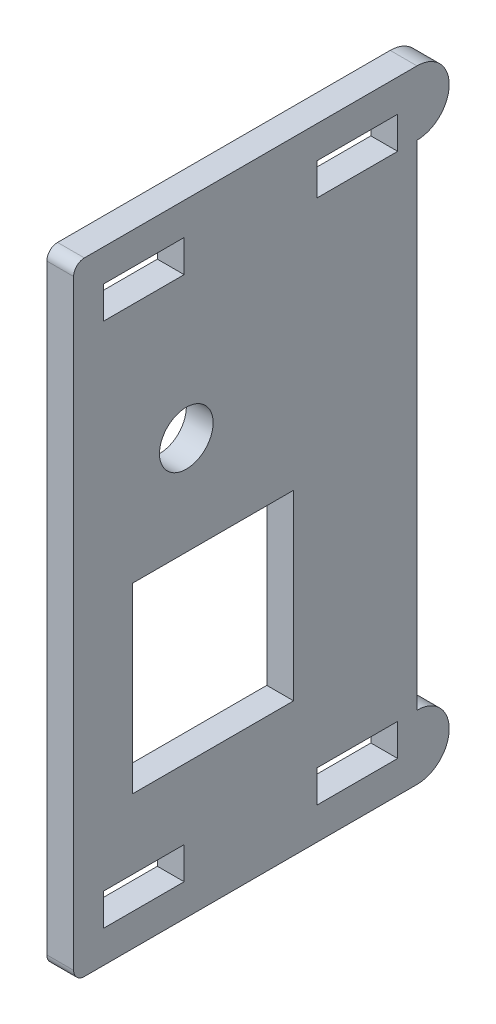
ISO-10303-21;
HEADER;
FILE_DESCRIPTION(('STEP AP214'),'2;1');
FILE_NAME('part.step','',(''),(''),'','','');
FILE_SCHEMA(('AUTOMOTIVE_DESIGN { 1 0 10303 214 1 1 1 1 }'));
ENDSEC;
DATA;
#1=APPLICATION_CONTEXT('core data for automotive mechanical design processes');
#2=APPLICATION_PROTOCOL_DEFINITION('international standard','automotive_design',2000,#1);
#3=PRODUCT_CONTEXT('',#1,'mechanical');
#4=PRODUCT('Part','Part','',(#3));
#5=PRODUCT_RELATED_PRODUCT_CATEGORY('part','',(#4));
#6=PRODUCT_DEFINITION_FORMATION('','',#4);
#7=PRODUCT_DEFINITION_CONTEXT('part definition',#1,'design');
#8=PRODUCT_DEFINITION('design','',#6,#7);
#9=PRODUCT_DEFINITION_SHAPE('','',#8);
#10=(LENGTH_UNIT() NAMED_UNIT(*) SI_UNIT(.MILLI.,.METRE.));
#11=(NAMED_UNIT(*) PLANE_ANGLE_UNIT() SI_UNIT($,.RADIAN.));
#12=(NAMED_UNIT(*) SI_UNIT($,.STERADIAN.) SOLID_ANGLE_UNIT());
#13=UNCERTAINTY_MEASURE_WITH_UNIT(LENGTH_MEASURE(1.E-05),#10,'distance_accuracy_value','');
#14=(GEOMETRIC_REPRESENTATION_CONTEXT(3) GLOBAL_UNCERTAINTY_ASSIGNED_CONTEXT((#13)) GLOBAL_UNIT_ASSIGNED_CONTEXT((#10,
#11,#12)) REPRESENTATION_CONTEXT('',''));
#15=CARTESIAN_POINT('',(0.,0.,0.));
#16=DIRECTION('',(0.,0.,1.));
#17=DIRECTION('',(1.,0.,0.));
#18=AXIS2_PLACEMENT_3D('',#15,#16,#17);
#19=CARTESIAN_POINT('',(2.5,0.,0.));
#20=DIRECTION('',(1.,0.,0.));
#21=DIRECTION('',(0.,0.,-1.));
#22=AXIS2_PLACEMENT_3D('',#19,#20,#21);
#23=PLANE('',#22);
#24=CARTESIAN_POINT('',(2.5,9.7,6.99999999999998));
#25=DIRECTION('',(-1.,0.,0.));
#26=DIRECTION('',(0.,0.,1.));
#27=AXIS2_PLACEMENT_3D('',#24,#25,#26);
#28=CIRCLE('',#27,2.5);
#29=CARTESIAN_POINT('',(2.5,9.7,9.49999999999998));
#30=VERTEX_POINT('',#29);
#31=EDGE_CURVE('E278',#30,#30,#28,.T.);
#32=ORIENTED_EDGE('',*,*,#31,.T.);
#33=EDGE_LOOP('',(#32));
#34=FACE_BOUND('',#33,.T.);
#35=DIRECTION('',(0.,-1.,0.));
#36=VECTOR('',#35,1.);
#37=CARTESIAN_POINT('',(2.5,0.500000000000006,-3.00000000000002));
#38=LINE('',#37,#36);
#39=CARTESIAN_POINT('',(2.5,0.500000000000006,-3.00000000000002));
#40=VERTEX_POINT('',#39);
#41=CARTESIAN_POINT('',(2.5,-16.5,-3.00000000000002));
#42=VERTEX_POINT('',#41);
#43=EDGE_CURVE('E245',#40,#42,#38,.T.);
#44=ORIENTED_EDGE('',*,*,#43,.T.);
#45=DIRECTION('',(0.,0.,1.));
#46=VECTOR('',#45,1.);
#47=CARTESIAN_POINT('',(2.5,-16.5,-3.00000000000002));
#48=LINE('',#47,#46);
#49=CARTESIAN_POINT('',(2.5,-16.5,12.));
#50=VERTEX_POINT('',#49);
#51=EDGE_CURVE('E257',#42,#50,#48,.T.);
#52=ORIENTED_EDGE('',*,*,#51,.T.);
#53=DIRECTION('',(0.,1.,0.));
#54=VECTOR('',#53,1.);
#55=CARTESIAN_POINT('',(2.5,0.500000000000006,12.));
#56=LINE('',#55,#54);
#57=CARTESIAN_POINT('',(2.5,0.500000000000006,12.));
#58=VERTEX_POINT('',#57);
#59=EDGE_CURVE('E261',#50,#58,#56,.T.);
#60=ORIENTED_EDGE('',*,*,#59,.T.);
#61=DIRECTION('',(0.,0.,-1.));
#62=VECTOR('',#61,1.);
#63=CARTESIAN_POINT('',(2.5,0.500000000000006,-3.00000000000002));
#64=LINE('',#63,#62);
#65=EDGE_CURVE('E253',#58,#40,#64,.T.);
#66=ORIENTED_EDGE('',*,*,#65,.T.);
#67=EDGE_LOOP('',(#44,#52,#60,#66));
#68=FACE_BOUND('',#67,.T.);
#69=DIRECTION('',(0.,0.,-1.));
#70=VECTOR('',#69,1.);
#71=CARTESIAN_POINT('',(2.5,-23.,14.7));
#72=LINE('',#71,#70);
#73=CARTESIAN_POINT('',(2.5,-23.,14.7));
#74=VERTEX_POINT('',#73);
#75=CARTESIAN_POINT('',(2.5,-23.,7.20000000000001));
#76=VERTEX_POINT('',#75);
#77=EDGE_CURVE('E315',#74,#76,#72,.T.);
#78=ORIENTED_EDGE('',*,*,#77,.T.);
#79=DIRECTION('',(0.,-1.,0.));
#80=VECTOR('',#79,1.);
#81=CARTESIAN_POINT('',(2.5,-23.,7.20000000000001));
#82=LINE('',#81,#80);
#83=CARTESIAN_POINT('',(2.5,-26.,7.20000000000001));
#84=VERTEX_POINT('',#83);
#85=EDGE_CURVE('E318',#76,#84,#82,.T.);
#86=ORIENTED_EDGE('',*,*,#85,.T.);
#87=DIRECTION('',(0.,0.,1.));
#88=VECTOR('',#87,1.);
#89=CARTESIAN_POINT('',(2.5,-26.,7.20000000000001));
#90=LINE('',#89,#88);
#91=CARTESIAN_POINT('',(2.5,-26.,14.7));
#92=VERTEX_POINT('',#91);
#93=EDGE_CURVE('E322',#84,#92,#90,.T.);
#94=ORIENTED_EDGE('',*,*,#93,.T.);
#95=DIRECTION('',(0.,1.,0.));
#96=VECTOR('',#95,1.);
#97=CARTESIAN_POINT('',(2.5,-26.,14.7));
#98=LINE('',#97,#96);
#99=EDGE_CURVE('E325',#92,#74,#98,.T.);
#100=ORIENTED_EDGE('',*,*,#99,.T.);
#101=EDGE_LOOP('',(#78,#86,#94,#100));
#102=FACE_BOUND('',#101,.T.);
#103=DIRECTION('',(0.,0.,-1.));
#104=VECTOR('',#103,1.);
#105=CARTESIAN_POINT('',(2.5,-23.,-5.2));
#106=LINE('',#105,#104);
#107=CARTESIAN_POINT('',(2.5,-23.,-5.2));
#108=VERTEX_POINT('',#107);
#109=CARTESIAN_POINT('',(2.5,-23.,-12.7));
#110=VERTEX_POINT('',#109);
#111=EDGE_CURVE('E347',#108,#110,#106,.T.);
#112=ORIENTED_EDGE('',*,*,#111,.T.);
#113=DIRECTION('',(0.,-1.,0.));
#114=VECTOR('',#113,1.);
#115=CARTESIAN_POINT('',(2.5,-23.,-12.7));
#116=LINE('',#115,#114);
#117=CARTESIAN_POINT('',(2.5,-26.,-12.7));
#118=VERTEX_POINT('',#117);
#119=EDGE_CURVE('E350',#110,#118,#116,.T.);
#120=ORIENTED_EDGE('',*,*,#119,.T.);
#121=DIRECTION('',(0.,0.,1.));
#122=VECTOR('',#121,1.);
#123=CARTESIAN_POINT('',(2.5,-26.,-12.7));
#124=LINE('',#123,#122);
#125=CARTESIAN_POINT('',(2.5,-26.,-5.2));
#126=VERTEX_POINT('',#125);
#127=EDGE_CURVE('E354',#118,#126,#124,.T.);
#128=ORIENTED_EDGE('',*,*,#127,.T.);
#129=DIRECTION('',(0.,1.,0.));
#130=VECTOR('',#129,1.);
#131=CARTESIAN_POINT('',(2.5,-26.,-5.2));
#132=LINE('',#131,#130);
#133=EDGE_CURVE('E357',#126,#108,#132,.T.);
#134=ORIENTED_EDGE('',*,*,#133,.T.);
#135=EDGE_LOOP('',(#112,#120,#128,#134));
#136=FACE_BOUND('',#135,.T.);
#137=DIRECTION('',(0.,-1.,0.));
#138=VECTOR('',#137,1.);
#139=CARTESIAN_POINT('',(2.5,23.,7.2));
#140=LINE('',#139,#138);
#141=CARTESIAN_POINT('',(2.5,26.,7.2));
#142=VERTEX_POINT('',#141);
#143=CARTESIAN_POINT('',(2.5,23.,7.2));
#144=VERTEX_POINT('',#143);
#145=EDGE_CURVE('E379',#142,#144,#140,.T.);
#146=ORIENTED_EDGE('',*,*,#145,.T.);
#147=DIRECTION('',(0.,0.,1.));
#148=VECTOR('',#147,1.);
#149=CARTESIAN_POINT('',(2.5,23.,14.7));
#150=LINE('',#149,#148);
#151=CARTESIAN_POINT('',(2.5,23.,14.7));
#152=VERTEX_POINT('',#151);
#153=EDGE_CURVE('E382',#144,#152,#150,.T.);
#154=ORIENTED_EDGE('',*,*,#153,.T.);
#155=DIRECTION('',(0.,1.,0.));
#156=VECTOR('',#155,1.);
#157=CARTESIAN_POINT('',(2.5,26.,14.7));
#158=LINE('',#157,#156);
#159=CARTESIAN_POINT('',(2.5,26.,14.7));
#160=VERTEX_POINT('',#159);
#161=EDGE_CURVE('E386',#152,#160,#158,.T.);
#162=ORIENTED_EDGE('',*,*,#161,.T.);
#163=DIRECTION('',(0.,0.,-1.));
#164=VECTOR('',#163,1.);
#165=CARTESIAN_POINT('',(2.5,26.,7.2));
#166=LINE('',#165,#164);
#167=EDGE_CURVE('E389',#160,#142,#166,.T.);
#168=ORIENTED_EDGE('',*,*,#167,.T.);
#169=EDGE_LOOP('',(#146,#154,#162,#168));
#170=FACE_BOUND('',#169,.T.);
#171=DIRECTION('',(0.,-1.,0.));
#172=VECTOR('',#171,1.);
#173=CARTESIAN_POINT('',(2.5,23.,-12.7));
#174=LINE('',#173,#172);
#175=CARTESIAN_POINT('',(2.5,26.,-12.7));
#176=VERTEX_POINT('',#175);
#177=CARTESIAN_POINT('',(2.5,23.,-12.7));
#178=VERTEX_POINT('',#177);
#179=EDGE_CURVE('E411',#176,#178,#174,.T.);
#180=ORIENTED_EDGE('',*,*,#179,.T.);
#181=DIRECTION('',(0.,0.,1.));
#182=VECTOR('',#181,1.);
#183=CARTESIAN_POINT('',(2.5,23.,-5.20000000000001));
#184=LINE('',#183,#182);
#185=CARTESIAN_POINT('',(2.5,23.,-5.20000000000001));
#186=VERTEX_POINT('',#185);
#187=EDGE_CURVE('E414',#178,#186,#184,.T.);
#188=ORIENTED_EDGE('',*,*,#187,.T.);
#189=DIRECTION('',(0.,1.,0.));
#190=VECTOR('',#189,1.);
#191=CARTESIAN_POINT('',(2.5,26.,-5.20000000000001));
#192=LINE('',#191,#190);
#193=CARTESIAN_POINT('',(2.5,26.,-5.20000000000001));
#194=VERTEX_POINT('',#193);
#195=EDGE_CURVE('E418',#186,#194,#192,.T.);
#196=ORIENTED_EDGE('',*,*,#195,.T.);
#197=DIRECTION('',(0.,0.,-1.));
#198=VECTOR('',#197,1.);
#199=CARTESIAN_POINT('',(2.5,26.,-12.7));
#200=LINE('',#199,#198);
#201=EDGE_CURVE('E421',#194,#176,#200,.T.);
#202=ORIENTED_EDGE('',*,*,#201,.T.);
#203=EDGE_LOOP('',(#180,#188,#196,#202));
#204=FACE_BOUND('',#203,.T.);
#205=DIRECTION('',(0.,-1.,0.));
#206=VECTOR('',#205,1.);
#207=CARTESIAN_POINT('',(2.5,29.,17.5));
#208=LINE('',#207,#206);
#209=CARTESIAN_POINT('',(2.5,28.,17.5));
#210=VERTEX_POINT('',#209);
#211=CARTESIAN_POINT('',(2.5,-28.,17.5));
#212=VERTEX_POINT('',#211);
#213=EDGE_CURVE('E445',#210,#212,#208,.T.);
#214=ORIENTED_EDGE('',*,*,#213,.T.);
#215=CARTESIAN_POINT('',(2.5,-28.,16.5));
#216=DIRECTION('',(1.,0.,0.));
#217=DIRECTION('',(0.,0.,-1.));
#218=AXIS2_PLACEMENT_3D('',#215,#216,#217);
#219=CIRCLE('',#218,1.);
#220=CARTESIAN_POINT('',(2.5,-29.,16.5));
#221=VERTEX_POINT('',#220);
#222=EDGE_CURVE('E62',#212,#221,#219,.T.);
#223=ORIENTED_EDGE('',*,*,#222,.T.);
#224=DIRECTION('',(0.,0.,-1.));
#225=VECTOR('',#224,1.);
#226=CARTESIAN_POINT('',(2.5,-29.,17.5));
#227=LINE('',#226,#225);
#228=CARTESIAN_POINT('',(2.5,-29.,-14.5));
#229=VERTEX_POINT('',#228);
#230=EDGE_CURVE('E448',#221,#229,#227,.T.);
#231=ORIENTED_EDGE('',*,*,#230,.T.);
#232=CARTESIAN_POINT('',(2.5,-26.,-14.5));
#233=DIRECTION('',(-1.,0.,0.));
#234=DIRECTION('',(0.,0.,1.));
#235=AXIS2_PLACEMENT_3D('',#232,#233,#234);
#236=CIRCLE('',#235,2.99999999999999);
#237=CARTESIAN_POINT('',(2.5,-23.,-14.5));
#238=VERTEX_POINT('',#237);
#239=EDGE_CURVE('E296',#229,#238,#236,.F.);
#240=ORIENTED_EDGE('',*,*,#239,.T.);
#241=DIRECTION('',(0.,-1.,0.));
#242=VECTOR('',#241,1.);
#243=CARTESIAN_POINT('',(2.5,0.,-14.5));
#244=LINE('',#243,#242);
#245=CARTESIAN_POINT('',(2.5,23.,-14.5));
#246=VERTEX_POINT('',#245);
#247=EDGE_CURVE('E300',#246,#238,#244,.T.);
#248=ORIENTED_EDGE('',*,*,#247,.F.);
#249=CARTESIAN_POINT('',(2.5,26.,-14.5));
#250=DIRECTION('',(-1.,0.,0.));
#251=DIRECTION('',(0.,0.,1.));
#252=AXIS2_PLACEMENT_3D('',#249,#250,#251);
#253=CIRCLE('',#252,2.99999999999999);
#254=CARTESIAN_POINT('',(2.5,29.,-14.5));
#255=VERTEX_POINT('',#254);
#256=EDGE_CURVE('E294',#255,#246,#253,.T.);
#257=ORIENTED_EDGE('',*,*,#256,.F.);
#258=DIRECTION('',(0.,0.,1.));
#259=VECTOR('',#258,1.);
#260=CARTESIAN_POINT('',(2.5,29.,17.5));
#261=LINE('',#260,#259);
#262=CARTESIAN_POINT('',(2.5,29.,16.5));
#263=VERTEX_POINT('',#262);
#264=EDGE_CURVE('E443',#255,#263,#261,.T.);
#265=ORIENTED_EDGE('',*,*,#264,.T.);
#266=CARTESIAN_POINT('',(2.5,28.,16.5));
#267=DIRECTION('',(1.,0.,0.));
#268=DIRECTION('',(0.,0.,-1.));
#269=AXIS2_PLACEMENT_3D('',#266,#267,#268);
#270=CIRCLE('',#269,1.);
#271=EDGE_CURVE('E465',#263,#210,#270,.T.);
#272=ORIENTED_EDGE('',*,*,#271,.T.);
#273=EDGE_LOOP('',(#214,#223,#231,#240,#248,#257,#265,#272));
#274=FACE_BOUND('',#273,.T.);
#275=ADVANCED_FACE('F54',(#34,#68,#102,#136,#170,#204,#274),#23,.T.);
#276=CARTESIAN_POINT('',(0.,0.,0.));
#277=DIRECTION('',(1.,0.,0.));
#278=DIRECTION('',(0.,0.,-1.));
#279=AXIS2_PLACEMENT_3D('',#276,#277,#278);
#280=PLANE('',#279);
#281=CARTESIAN_POINT('',(0.,9.7,6.99999999999998));
#282=DIRECTION('',(-1.,0.,0.));
#283=DIRECTION('',(0.,0.,1.));
#284=AXIS2_PLACEMENT_3D('',#281,#282,#283);
#285=CIRCLE('',#284,2.5);
#286=CARTESIAN_POINT('',(0.,9.7,9.49999999999998));
#287=VERTEX_POINT('',#286);
#288=EDGE_CURVE('E271',#287,#287,#285,.T.);
#289=ORIENTED_EDGE('',*,*,#288,.F.);
#290=EDGE_LOOP('',(#289));
#291=FACE_BOUND('',#290,.T.);
#292=DIRECTION('',(0.,0.,1.));
#293=VECTOR('',#292,1.);
#294=CARTESIAN_POINT('',(0.,-16.5,-3.00000000000002));
#295=LINE('',#294,#293);
#296=CARTESIAN_POINT('',(0.,-16.5,-3.00000000000002));
#297=VERTEX_POINT('',#296);
#298=CARTESIAN_POINT('',(0.,-16.5,12.));
#299=VERTEX_POINT('',#298);
#300=EDGE_CURVE('E277',#297,#299,#295,.T.);
#301=ORIENTED_EDGE('',*,*,#300,.F.);
#302=DIRECTION('',(0.,-1.,0.));
#303=VECTOR('',#302,1.);
#304=CARTESIAN_POINT('',(0.,0.500000000000006,-3.00000000000002));
#305=LINE('',#304,#303);
#306=CARTESIAN_POINT('',(0.,0.500000000000006,-3.00000000000002));
#307=VERTEX_POINT('',#306);
#308=EDGE_CURVE('E248',#307,#297,#305,.T.);
#309=ORIENTED_EDGE('',*,*,#308,.F.);
#310=DIRECTION('',(0.,0.,-1.));
#311=VECTOR('',#310,1.);
#312=CARTESIAN_POINT('',(0.,0.500000000000006,-3.00000000000002));
#313=LINE('',#312,#311);
#314=CARTESIAN_POINT('',(0.,0.500000000000006,12.));
#315=VERTEX_POINT('',#314);
#316=EDGE_CURVE('E265',#315,#307,#313,.T.);
#317=ORIENTED_EDGE('',*,*,#316,.F.);
#318=DIRECTION('',(0.,1.,0.));
#319=VECTOR('',#318,1.);
#320=CARTESIAN_POINT('',(0.,0.500000000000006,12.));
#321=LINE('',#320,#319);
#322=EDGE_CURVE('E268',#299,#315,#321,.T.);
#323=ORIENTED_EDGE('',*,*,#322,.F.);
#324=EDGE_LOOP('',(#301,#309,#317,#323));
#325=FACE_BOUND('',#324,.T.);
#326=DIRECTION('',(0.,-1.,0.));
#327=VECTOR('',#326,1.);
#328=CARTESIAN_POINT('',(0.,-23.,7.20000000000001));
#329=LINE('',#328,#327);
#330=CARTESIAN_POINT('',(0.,-23.,7.20000000000001));
#331=VERTEX_POINT('',#330);
#332=CARTESIAN_POINT('',(0.,-26.,7.20000000000001));
#333=VERTEX_POINT('',#332);
#334=EDGE_CURVE('E330',#331,#333,#329,.T.);
#335=ORIENTED_EDGE('',*,*,#334,.F.);
#336=DIRECTION('',(0.,0.,-1.));
#337=VECTOR('',#336,1.);
#338=CARTESIAN_POINT('',(0.,-23.,14.7));
#339=LINE('',#338,#337);
#340=CARTESIAN_POINT('',(0.,-23.,14.7));
#341=VERTEX_POINT('',#340);
#342=EDGE_CURVE('E313',#341,#331,#339,.T.);
#343=ORIENTED_EDGE('',*,*,#342,.F.);
#344=DIRECTION('',(0.,1.,0.));
#345=VECTOR('',#344,1.);
#346=CARTESIAN_POINT('',(0.,-26.,14.7));
#347=LINE('',#346,#345);
#348=CARTESIAN_POINT('',(0.,-26.,14.7));
#349=VERTEX_POINT('',#348);
#350=EDGE_CURVE('E319',#349,#341,#347,.T.);
#351=ORIENTED_EDGE('',*,*,#350,.F.);
#352=DIRECTION('',(0.,0.,1.));
#353=VECTOR('',#352,1.);
#354=CARTESIAN_POINT('',(0.,-26.,7.20000000000001));
#355=LINE('',#354,#353);
#356=EDGE_CURVE('E333',#333,#349,#355,.T.);
#357=ORIENTED_EDGE('',*,*,#356,.F.);
#358=EDGE_LOOP('',(#335,#343,#351,#357));
#359=FACE_BOUND('',#358,.T.);
#360=DIRECTION('',(0.,-1.,0.));
#361=VECTOR('',#360,1.);
#362=CARTESIAN_POINT('',(0.,-23.,-12.7));
#363=LINE('',#362,#361);
#364=CARTESIAN_POINT('',(0.,-23.,-12.7));
#365=VERTEX_POINT('',#364);
#366=CARTESIAN_POINT('',(0.,-26.,-12.7));
#367=VERTEX_POINT('',#366);
#368=EDGE_CURVE('E362',#365,#367,#363,.T.);
#369=ORIENTED_EDGE('',*,*,#368,.F.);
#370=DIRECTION('',(0.,0.,-1.));
#371=VECTOR('',#370,1.);
#372=CARTESIAN_POINT('',(0.,-23.,-5.2));
#373=LINE('',#372,#371);
#374=CARTESIAN_POINT('',(0.,-23.,-5.2));
#375=VERTEX_POINT('',#374);
#376=EDGE_CURVE('E340',#375,#365,#373,.T.);
#377=ORIENTED_EDGE('',*,*,#376,.F.);
#378=DIRECTION('',(0.,1.,0.));
#379=VECTOR('',#378,1.);
#380=CARTESIAN_POINT('',(0.,-26.,-5.2));
#381=LINE('',#380,#379);
#382=CARTESIAN_POINT('',(0.,-26.,-5.2));
#383=VERTEX_POINT('',#382);
#384=EDGE_CURVE('E351',#383,#375,#381,.T.);
#385=ORIENTED_EDGE('',*,*,#384,.F.);
#386=DIRECTION('',(0.,0.,1.));
#387=VECTOR('',#386,1.);
#388=CARTESIAN_POINT('',(0.,-26.,-12.7));
#389=LINE('',#388,#387);
#390=EDGE_CURVE('E365',#367,#383,#389,.T.);
#391=ORIENTED_EDGE('',*,*,#390,.F.);
#392=EDGE_LOOP('',(#369,#377,#385,#391));
#393=FACE_BOUND('',#392,.T.);
#394=DIRECTION('',(0.,0.,1.));
#395=VECTOR('',#394,1.);
#396=CARTESIAN_POINT('',(0.,23.,14.7));
#397=LINE('',#396,#395);
#398=CARTESIAN_POINT('',(0.,23.,7.2));
#399=VERTEX_POINT('',#398);
#400=CARTESIAN_POINT('',(0.,23.,14.7));
#401=VERTEX_POINT('',#400);
#402=EDGE_CURVE('E394',#399,#401,#397,.T.);
#403=ORIENTED_EDGE('',*,*,#402,.F.);
#404=DIRECTION('',(0.,-1.,0.));
#405=VECTOR('',#404,1.);
#406=CARTESIAN_POINT('',(0.,23.,7.2));
#407=LINE('',#406,#405);
#408=CARTESIAN_POINT('',(0.,26.,7.2));
#409=VERTEX_POINT('',#408);
#410=EDGE_CURVE('E372',#409,#399,#407,.T.);
#411=ORIENTED_EDGE('',*,*,#410,.F.);
#412=DIRECTION('',(0.,0.,-1.));
#413=VECTOR('',#412,1.);
#414=CARTESIAN_POINT('',(0.,26.,7.2));
#415=LINE('',#414,#413);
#416=CARTESIAN_POINT('',(0.,26.,14.7));
#417=VERTEX_POINT('',#416);
#418=EDGE_CURVE('E383',#417,#409,#415,.T.);
#419=ORIENTED_EDGE('',*,*,#418,.F.);
#420=DIRECTION('',(0.,1.,0.));
#421=VECTOR('',#420,1.);
#422=CARTESIAN_POINT('',(0.,26.,14.7));
#423=LINE('',#422,#421);
#424=EDGE_CURVE('E397',#401,#417,#423,.T.);
#425=ORIENTED_EDGE('',*,*,#424,.F.);
#426=EDGE_LOOP('',(#403,#411,#419,#425));
#427=FACE_BOUND('',#426,.T.);
#428=DIRECTION('',(0.,0.,1.));
#429=VECTOR('',#428,1.);
#430=CARTESIAN_POINT('',(0.,23.,-5.20000000000001));
#431=LINE('',#430,#429);
#432=CARTESIAN_POINT('',(0.,23.,-12.7));
#433=VERTEX_POINT('',#432);
#434=CARTESIAN_POINT('',(0.,23.,-5.20000000000001));
#435=VERTEX_POINT('',#434);
#436=EDGE_CURVE('E426',#433,#435,#431,.T.);
#437=ORIENTED_EDGE('',*,*,#436,.F.);
#438=DIRECTION('',(0.,-1.,0.));
#439=VECTOR('',#438,1.);
#440=CARTESIAN_POINT('',(0.,23.,-12.7));
#441=LINE('',#440,#439);
#442=CARTESIAN_POINT('',(0.,26.,-12.7));
#443=VERTEX_POINT('',#442);
#444=EDGE_CURVE('E404',#443,#433,#441,.T.);
#445=ORIENTED_EDGE('',*,*,#444,.F.);
#446=DIRECTION('',(0.,0.,-1.));
#447=VECTOR('',#446,1.);
#448=CARTESIAN_POINT('',(0.,26.,-12.7));
#449=LINE('',#448,#447);
#450=CARTESIAN_POINT('',(0.,26.,-5.20000000000001));
#451=VERTEX_POINT('',#450);
#452=EDGE_CURVE('E415',#451,#443,#449,.T.);
#453=ORIENTED_EDGE('',*,*,#452,.F.);
#454=DIRECTION('',(0.,1.,0.));
#455=VECTOR('',#454,1.);
#456=CARTESIAN_POINT('',(0.,26.,-5.20000000000001));
#457=LINE('',#456,#455);
#458=EDGE_CURVE('E429',#435,#451,#457,.T.);
#459=ORIENTED_EDGE('',*,*,#458,.F.);
#460=EDGE_LOOP('',(#437,#445,#453,#459));
#461=FACE_BOUND('',#460,.T.);
#462=DIRECTION('',(0.,0.,-1.));
#463=VECTOR('',#462,1.);
#464=CARTESIAN_POINT('',(0.,-29.,17.5));
#465=LINE('',#464,#463);
#466=CARTESIAN_POINT('',(0.,-29.,16.5));
#467=VERTEX_POINT('',#466);
#468=CARTESIAN_POINT('',(0.,-29.,-14.5));
#469=VERTEX_POINT('',#468);
#470=EDGE_CURVE('E446',#467,#469,#465,.T.);
#471=ORIENTED_EDGE('',*,*,#470,.F.);
#472=CARTESIAN_POINT('',(0.,-28.,16.5));
#473=DIRECTION('',(1.,0.,0.));
#474=DIRECTION('',(0.,0.,-1.));
#475=AXIS2_PLACEMENT_3D('',#472,#473,#474);
#476=CIRCLE('',#475,1.);
#477=CARTESIAN_POINT('',(0.,-28.,17.5));
#478=VERTEX_POINT('',#477);
#479=EDGE_CURVE('E459',#467,#478,#476,.F.);
#480=ORIENTED_EDGE('',*,*,#479,.T.);
#481=DIRECTION('',(0.,-1.,0.));
#482=VECTOR('',#481,1.);
#483=CARTESIAN_POINT('',(0.,29.,17.5));
#484=LINE('',#483,#482);
#485=CARTESIAN_POINT('',(0.,28.,17.5));
#486=VERTEX_POINT('',#485);
#487=EDGE_CURVE('E452',#486,#478,#484,.T.);
#488=ORIENTED_EDGE('',*,*,#487,.F.);
#489=CARTESIAN_POINT('',(0.,28.,16.5));
#490=DIRECTION('',(1.,0.,0.));
#491=DIRECTION('',(0.,0.,-1.));
#492=AXIS2_PLACEMENT_3D('',#489,#490,#491);
#493=CIRCLE('',#492,1.);
#494=CARTESIAN_POINT('',(0.,29.,16.5));
#495=VERTEX_POINT('',#494);
#496=EDGE_CURVE('E457',#486,#495,#493,.F.);
#497=ORIENTED_EDGE('',*,*,#496,.T.);
#498=DIRECTION('',(0.,0.,1.));
#499=VECTOR('',#498,1.);
#500=CARTESIAN_POINT('',(0.,29.,17.5));
#501=LINE('',#500,#499);
#502=CARTESIAN_POINT('',(0.,29.,-14.5));
#503=VERTEX_POINT('',#502);
#504=EDGE_CURVE('E436',#503,#495,#501,.T.);
#505=ORIENTED_EDGE('',*,*,#504,.F.);
#506=CARTESIAN_POINT('',(0.,26.,-14.5));
#507=DIRECTION('',(-1.,0.,0.));
#508=DIRECTION('',(0.,0.,1.));
#509=AXIS2_PLACEMENT_3D('',#506,#507,#508);
#510=CIRCLE('',#509,2.99999999999999);
#511=CARTESIAN_POINT('',(0.,23.,-14.5));
#512=VERTEX_POINT('',#511);
#513=EDGE_CURVE('E293',#503,#512,#510,.T.);
#514=ORIENTED_EDGE('',*,*,#513,.T.);
#515=DIRECTION('',(0.,-1.,0.));
#516=VECTOR('',#515,1.);
#517=CARTESIAN_POINT('',(0.,0.,-14.5));
#518=LINE('',#517,#516);
#519=CARTESIAN_POINT('',(0.,-23.,-14.5));
#520=VERTEX_POINT('',#519);
#521=EDGE_CURVE('E297',#512,#520,#518,.T.);
#522=ORIENTED_EDGE('',*,*,#521,.T.);
#523=CARTESIAN_POINT('',(0.,-26.,-14.5));
#524=DIRECTION('',(-1.,0.,0.));
#525=DIRECTION('',(0.,0.,1.));
#526=AXIS2_PLACEMENT_3D('',#523,#524,#525);
#527=CIRCLE('',#526,2.99999999999999);
#528=EDGE_CURVE('E305',#469,#520,#527,.F.);
#529=ORIENTED_EDGE('',*,*,#528,.F.);
#530=EDGE_LOOP('',(#471,#480,#488,#497,#505,#514,#522,#529));
#531=FACE_BOUND('',#530,.T.);
#532=ADVANCED_FACE('F479',(#291,#325,#359,#393,#427,#461,#531),#280,.F.);
#533=CARTESIAN_POINT('',(2.5,29.,17.5));
#534=DIRECTION('',(0.,-1.,0.));
#535=DIRECTION('',(0.,0.,-1.));
#536=AXIS2_PLACEMENT_3D('',#533,#534,#535);
#537=PLANE('',#536);
#538=ORIENTED_EDGE('',*,*,#504,.T.);
#539=DIRECTION('',(-1.,0.,0.));
#540=VECTOR('',#539,1.);
#541=CARTESIAN_POINT('',(2.5,29.,16.5));
#542=LINE('',#541,#540);
#543=EDGE_CURVE('E12',#495,#263,#542,.F.);
#544=ORIENTED_EDGE('',*,*,#543,.T.);
#545=ORIENTED_EDGE('',*,*,#264,.F.);
#546=DIRECTION('',(-1.,0.,0.));
#547=VECTOR('',#546,1.);
#548=CARTESIAN_POINT('',(2.5,29.,-14.5));
#549=LINE('',#548,#547);
#550=EDGE_CURVE('E284',#255,#503,#549,.T.);
#551=ORIENTED_EDGE('',*,*,#550,.T.);
#552=EDGE_LOOP('',(#538,#544,#545,#551));
#553=FACE_BOUND('',#552,.T.);
#554=ADVANCED_FACE('F486',(#553),#537,.F.);
#555=CARTESIAN_POINT('',(2.5,29.,17.5));
#556=DIRECTION('',(0.,0.,-1.));
#557=DIRECTION('',(0.,1.,0.));
#558=AXIS2_PLACEMENT_3D('',#555,#556,#557);
#559=PLANE('',#558);
#560=ORIENTED_EDGE('',*,*,#487,.T.);
#561=DIRECTION('',(-1.,0.,0.));
#562=VECTOR('',#561,1.);
#563=CARTESIAN_POINT('',(2.5,-28.,17.5));
#564=LINE('',#563,#562);
#565=EDGE_CURVE('E75',#478,#212,#564,.F.);
#566=ORIENTED_EDGE('',*,*,#565,.T.);
#567=ORIENTED_EDGE('',*,*,#213,.F.);
#568=DIRECTION('',(-1.,0.,0.));
#569=VECTOR('',#568,1.);
#570=CARTESIAN_POINT('',(2.5,28.,17.5));
#571=LINE('',#570,#569);
#572=EDGE_CURVE('E461',#210,#486,#571,.T.);
#573=ORIENTED_EDGE('',*,*,#572,.T.);
#574=EDGE_LOOP('',(#560,#566,#567,#573));
#575=FACE_BOUND('',#574,.T.);
#576=ADVANCED_FACE('F481',(#575),#559,.F.);
#577=CARTESIAN_POINT('',(2.5,-29.,17.5));
#578=DIRECTION('',(0.,1.,0.));
#579=DIRECTION('',(0.,0.,1.));
#580=AXIS2_PLACEMENT_3D('',#577,#578,#579);
#581=PLANE('',#580);
#582=ORIENTED_EDGE('',*,*,#230,.F.);
#583=DIRECTION('',(-1.,0.,0.));
#584=VECTOR('',#583,1.);
#585=CARTESIAN_POINT('',(2.5,-29.,16.5));
#586=LINE('',#585,#584);
#587=EDGE_CURVE('E450',#221,#467,#586,.T.);
#588=ORIENTED_EDGE('',*,*,#587,.T.);
#589=ORIENTED_EDGE('',*,*,#470,.T.);
#590=DIRECTION('',(-1.,0.,0.));
#591=VECTOR('',#590,1.);
#592=CARTESIAN_POINT('',(2.5,-29.,-14.5));
#593=LINE('',#592,#591);
#594=EDGE_CURVE('E290',#229,#469,#593,.T.);
#595=ORIENTED_EDGE('',*,*,#594,.F.);
#596=EDGE_LOOP('',(#582,#588,#589,#595));
#597=FACE_BOUND('',#596,.T.);
#598=ADVANCED_FACE('F474',(#597),#581,.F.);
#599=CARTESIAN_POINT('',(2.5,23.,-12.7));
#600=DIRECTION('',(0.,0.,-1.));
#601=DIRECTION('',(-1.,0.,0.));
#602=AXIS2_PLACEMENT_3D('',#599,#600,#601);
#603=PLANE('',#602);
#604=ORIENTED_EDGE('',*,*,#444,.T.);
#605=DIRECTION('',(-1.,0.,0.));
#606=VECTOR('',#605,1.);
#607=CARTESIAN_POINT('',(2.5,23.,-12.7));
#608=LINE('',#607,#606);
#609=EDGE_CURVE('E424',#178,#433,#608,.T.);
#610=ORIENTED_EDGE('',*,*,#609,.F.);
#611=ORIENTED_EDGE('',*,*,#179,.F.);
#612=DIRECTION('',(-1.,0.,0.));
#613=VECTOR('',#612,1.);
#614=CARTESIAN_POINT('',(2.5,26.,-12.7));
#615=LINE('',#614,#613);
#616=EDGE_CURVE('E434',#176,#443,#615,.T.);
#617=ORIENTED_EDGE('',*,*,#616,.T.);
#618=EDGE_LOOP('',(#604,#610,#611,#617));
#619=FACE_BOUND('',#618,.T.);
#620=ADVANCED_FACE('F522',(#619),#603,.F.);
#621=CARTESIAN_POINT('',(2.5,26.,-12.7));
#622=DIRECTION('',(0.,1.,0.));
#623=DIRECTION('',(0.,0.,1.));
#624=AXIS2_PLACEMENT_3D('',#621,#622,#623);
#625=PLANE('',#624);
#626=ORIENTED_EDGE('',*,*,#452,.T.);
#627=ORIENTED_EDGE('',*,*,#616,.F.);
#628=ORIENTED_EDGE('',*,*,#201,.F.);
#629=DIRECTION('',(-1.,0.,0.));
#630=VECTOR('',#629,1.);
#631=CARTESIAN_POINT('',(2.5,26.,-5.20000000000001));
#632=LINE('',#631,#630);
#633=EDGE_CURVE('E437',#194,#451,#632,.T.);
#634=ORIENTED_EDGE('',*,*,#633,.T.);
#635=EDGE_LOOP('',(#626,#627,#628,#634));
#636=FACE_BOUND('',#635,.T.);
#637=ADVANCED_FACE('F581',(#636),#625,.F.);
#638=CARTESIAN_POINT('',(2.5,26.,-5.20000000000001));
#639=DIRECTION('',(0.,0.,1.));
#640=DIRECTION('',(1.,0.,0.));
#641=AXIS2_PLACEMENT_3D('',#638,#639,#640);
#642=PLANE('',#641);
#643=ORIENTED_EDGE('',*,*,#458,.T.);
#644=ORIENTED_EDGE('',*,*,#633,.F.);
#645=ORIENTED_EDGE('',*,*,#195,.F.);
#646=DIRECTION('',(-1.,0.,0.));
#647=VECTOR('',#646,1.);
#648=CARTESIAN_POINT('',(2.5,23.,-5.20000000000001));
#649=LINE('',#648,#647);
#650=EDGE_CURVE('E439',#186,#435,#649,.T.);
#651=ORIENTED_EDGE('',*,*,#650,.T.);
#652=EDGE_LOOP('',(#643,#644,#645,#651));
#653=FACE_BOUND('',#652,.T.);
#654=ADVANCED_FACE('F583',(#653),#642,.F.);
#655=CARTESIAN_POINT('',(2.5,23.,-5.20000000000001));
#656=DIRECTION('',(0.,-1.,0.));
#657=DIRECTION('',(0.,0.,-1.));
#658=AXIS2_PLACEMENT_3D('',#655,#656,#657);
#659=PLANE('',#658);
#660=ORIENTED_EDGE('',*,*,#436,.T.);
#661=ORIENTED_EDGE('',*,*,#650,.F.);
#662=ORIENTED_EDGE('',*,*,#187,.F.);
#663=ORIENTED_EDGE('',*,*,#609,.T.);
#664=EDGE_LOOP('',(#660,#661,#662,#663));
#665=FACE_BOUND('',#664,.T.);
#666=ADVANCED_FACE('F575',(#665),#659,.F.);
#667=CARTESIAN_POINT('',(2.5,23.,7.2));
#668=DIRECTION('',(0.,0.,-1.));
#669=DIRECTION('',(0.,1.,0.));
#670=AXIS2_PLACEMENT_3D('',#667,#668,#669);
#671=PLANE('',#670);
#672=ORIENTED_EDGE('',*,*,#410,.T.);
#673=DIRECTION('',(-1.,0.,0.));
#674=VECTOR('',#673,1.);
#675=CARTESIAN_POINT('',(2.5,23.,7.2));
#676=LINE('',#675,#674);
#677=EDGE_CURVE('E392',#144,#399,#676,.T.);
#678=ORIENTED_EDGE('',*,*,#677,.F.);
#679=ORIENTED_EDGE('',*,*,#145,.F.);
#680=DIRECTION('',(-1.,0.,0.));
#681=VECTOR('',#680,1.);
#682=CARTESIAN_POINT('',(2.5,26.,7.2));
#683=LINE('',#682,#681);
#684=EDGE_CURVE('E402',#142,#409,#683,.T.);
#685=ORIENTED_EDGE('',*,*,#684,.T.);
#686=EDGE_LOOP('',(#672,#678,#679,#685));
#687=FACE_BOUND('',#686,.T.);
#688=ADVANCED_FACE('F591',(#687),#671,.F.);
#689=CARTESIAN_POINT('',(2.5,26.,7.2));
#690=DIRECTION('',(0.,1.,0.));
#691=DIRECTION('',(0.,0.,1.));
#692=AXIS2_PLACEMENT_3D('',#689,#690,#691);
#693=PLANE('',#692);
#694=ORIENTED_EDGE('',*,*,#418,.T.);
#695=ORIENTED_EDGE('',*,*,#684,.F.);
#696=ORIENTED_EDGE('',*,*,#167,.F.);
#697=DIRECTION('',(-1.,0.,0.));
#698=VECTOR('',#697,1.);
#699=CARTESIAN_POINT('',(2.5,26.,14.7));
#700=LINE('',#699,#698);
#701=EDGE_CURVE('E405',#160,#417,#700,.T.);
#702=ORIENTED_EDGE('',*,*,#701,.T.);
#703=EDGE_LOOP('',(#694,#695,#696,#702));
#704=FACE_BOUND('',#703,.T.);
#705=ADVANCED_FACE('F596',(#704),#693,.F.);
#706=CARTESIAN_POINT('',(2.5,26.,14.7));
#707=DIRECTION('',(0.,0.,1.));
#708=DIRECTION('',(1.,0.,0.));
#709=AXIS2_PLACEMENT_3D('',#706,#707,#708);
#710=PLANE('',#709);
#711=ORIENTED_EDGE('',*,*,#424,.T.);
#712=ORIENTED_EDGE('',*,*,#701,.F.);
#713=ORIENTED_EDGE('',*,*,#161,.F.);
#714=DIRECTION('',(-1.,0.,0.));
#715=VECTOR('',#714,1.);
#716=CARTESIAN_POINT('',(2.5,23.,14.7));
#717=LINE('',#716,#715);
#718=EDGE_CURVE('E407',#152,#401,#717,.T.);
#719=ORIENTED_EDGE('',*,*,#718,.T.);
#720=EDGE_LOOP('',(#711,#712,#713,#719));
#721=FACE_BOUND('',#720,.T.);
#722=ADVANCED_FACE('F602',(#721),#710,.F.);
#723=CARTESIAN_POINT('',(2.5,23.,14.7));
#724=DIRECTION('',(0.,-1.,0.));
#725=DIRECTION('',(0.,0.,-1.));
#726=AXIS2_PLACEMENT_3D('',#723,#724,#725);
#727=PLANE('',#726);
#728=ORIENTED_EDGE('',*,*,#402,.T.);
#729=ORIENTED_EDGE('',*,*,#718,.F.);
#730=ORIENTED_EDGE('',*,*,#153,.F.);
#731=ORIENTED_EDGE('',*,*,#677,.T.);
#732=EDGE_LOOP('',(#728,#729,#730,#731));
#733=FACE_BOUND('',#732,.T.);
#734=ADVANCED_FACE('F598',(#733),#727,.F.);
#735=CARTESIAN_POINT('',(2.5,-23.,-5.2));
#736=DIRECTION('',(0.,1.,0.));
#737=DIRECTION('',(0.,0.,1.));
#738=AXIS2_PLACEMENT_3D('',#735,#736,#737);
#739=PLANE('',#738);
#740=ORIENTED_EDGE('',*,*,#376,.T.);
#741=DIRECTION('',(-1.,0.,0.));
#742=VECTOR('',#741,1.);
#743=CARTESIAN_POINT('',(2.5,-23.,-12.7));
#744=LINE('',#743,#742);
#745=EDGE_CURVE('E360',#110,#365,#744,.T.);
#746=ORIENTED_EDGE('',*,*,#745,.F.);
#747=ORIENTED_EDGE('',*,*,#111,.F.);
#748=DIRECTION('',(-1.,0.,0.));
#749=VECTOR('',#748,1.);
#750=CARTESIAN_POINT('',(2.5,-23.,-5.2));
#751=LINE('',#750,#749);
#752=EDGE_CURVE('E370',#108,#375,#751,.T.);
#753=ORIENTED_EDGE('',*,*,#752,.T.);
#754=EDGE_LOOP('',(#740,#746,#747,#753));
#755=FACE_BOUND('',#754,.T.);
#756=ADVANCED_FACE('F601',(#755),#739,.F.);
#757=CARTESIAN_POINT('',(2.5,-26.,-5.2));
#758=DIRECTION('',(0.,0.,1.));
#759=DIRECTION('',(0.,-1.,0.));
#760=AXIS2_PLACEMENT_3D('',#757,#758,#759);
#761=PLANE('',#760);
#762=ORIENTED_EDGE('',*,*,#384,.T.);
#763=ORIENTED_EDGE('',*,*,#752,.F.);
#764=ORIENTED_EDGE('',*,*,#133,.F.);
#765=DIRECTION('',(-1.,0.,0.));
#766=VECTOR('',#765,1.);
#767=CARTESIAN_POINT('',(2.5,-26.,-5.2));
#768=LINE('',#767,#766);
#769=EDGE_CURVE('E373',#126,#383,#768,.T.);
#770=ORIENTED_EDGE('',*,*,#769,.T.);
#771=EDGE_LOOP('',(#762,#763,#764,#770));
#772=FACE_BOUND('',#771,.T.);
#773=ADVANCED_FACE('F612',(#772),#761,.F.);
#774=CARTESIAN_POINT('',(2.5,-26.,-12.7));
#775=DIRECTION('',(0.,-1.,0.));
#776=DIRECTION('',(0.,0.,-1.));
#777=AXIS2_PLACEMENT_3D('',#774,#775,#776);
#778=PLANE('',#777);
#779=ORIENTED_EDGE('',*,*,#390,.T.);
#780=ORIENTED_EDGE('',*,*,#769,.F.);
#781=ORIENTED_EDGE('',*,*,#127,.F.);
#782=DIRECTION('',(-1.,0.,0.));
#783=VECTOR('',#782,1.);
#784=CARTESIAN_POINT('',(2.5,-26.,-12.7));
#785=LINE('',#784,#783);
#786=EDGE_CURVE('E375',#118,#367,#785,.T.);
#787=ORIENTED_EDGE('',*,*,#786,.T.);
#788=EDGE_LOOP('',(#779,#780,#781,#787));
#789=FACE_BOUND('',#788,.T.);
#790=ADVANCED_FACE('F618',(#789),#778,.F.);
#791=CARTESIAN_POINT('',(2.5,-23.,-12.7));
#792=DIRECTION('',(0.,0.,-1.));
#793=DIRECTION('',(0.,1.,0.));
#794=AXIS2_PLACEMENT_3D('',#791,#792,#793);
#795=PLANE('',#794);
#796=ORIENTED_EDGE('',*,*,#368,.T.);
#797=ORIENTED_EDGE('',*,*,#786,.F.);
#798=ORIENTED_EDGE('',*,*,#119,.F.);
#799=ORIENTED_EDGE('',*,*,#745,.T.);
#800=EDGE_LOOP('',(#796,#797,#798,#799));
#801=FACE_BOUND('',#800,.T.);
#802=ADVANCED_FACE('F614',(#801),#795,.F.);
#803=CARTESIAN_POINT('',(2.5,-23.,14.7));
#804=DIRECTION('',(0.,1.,0.));
#805=DIRECTION('',(0.,0.,1.));
#806=AXIS2_PLACEMENT_3D('',#803,#804,#805);
#807=PLANE('',#806);
#808=ORIENTED_EDGE('',*,*,#342,.T.);
#809=DIRECTION('',(-1.,0.,0.));
#810=VECTOR('',#809,1.);
#811=CARTESIAN_POINT('',(2.5,-23.,7.20000000000001));
#812=LINE('',#811,#810);
#813=EDGE_CURVE('E328',#76,#331,#812,.T.);
#814=ORIENTED_EDGE('',*,*,#813,.F.);
#815=ORIENTED_EDGE('',*,*,#77,.F.);
#816=DIRECTION('',(-1.,0.,0.));
#817=VECTOR('',#816,1.);
#818=CARTESIAN_POINT('',(2.5,-23.,14.7));
#819=LINE('',#818,#817);
#820=EDGE_CURVE('E338',#74,#341,#819,.T.);
#821=ORIENTED_EDGE('',*,*,#820,.T.);
#822=EDGE_LOOP('',(#808,#814,#815,#821));
#823=FACE_BOUND('',#822,.T.);
#824=ADVANCED_FACE('F617',(#823),#807,.F.);
#825=CARTESIAN_POINT('',(2.5,-26.,14.7));
#826=DIRECTION('',(0.,0.,1.));
#827=DIRECTION('',(0.,-1.,0.));
#828=AXIS2_PLACEMENT_3D('',#825,#826,#827);
#829=PLANE('',#828);
#830=ORIENTED_EDGE('',*,*,#350,.T.);
#831=ORIENTED_EDGE('',*,*,#820,.F.);
#832=ORIENTED_EDGE('',*,*,#99,.F.);
#833=DIRECTION('',(-1.,0.,0.));
#834=VECTOR('',#833,1.);
#835=CARTESIAN_POINT('',(2.5,-26.,14.7));
#836=LINE('',#835,#834);
#837=EDGE_CURVE('E341',#92,#349,#836,.T.);
#838=ORIENTED_EDGE('',*,*,#837,.T.);
#839=EDGE_LOOP('',(#830,#831,#832,#838));
#840=FACE_BOUND('',#839,.T.);
#841=ADVANCED_FACE('F627',(#840),#829,.F.);
#842=CARTESIAN_POINT('',(2.5,-26.,7.20000000000001));
#843=DIRECTION('',(0.,-1.,0.));
#844=DIRECTION('',(0.,0.,-1.));
#845=AXIS2_PLACEMENT_3D('',#842,#843,#844);
#846=PLANE('',#845);
#847=ORIENTED_EDGE('',*,*,#356,.T.);
#848=ORIENTED_EDGE('',*,*,#837,.F.);
#849=ORIENTED_EDGE('',*,*,#93,.F.);
#850=DIRECTION('',(-1.,0.,0.));
#851=VECTOR('',#850,1.);
#852=CARTESIAN_POINT('',(2.5,-26.,7.20000000000001));
#853=LINE('',#852,#851);
#854=EDGE_CURVE('E343',#84,#333,#853,.T.);
#855=ORIENTED_EDGE('',*,*,#854,.T.);
#856=EDGE_LOOP('',(#847,#848,#849,#855));
#857=FACE_BOUND('',#856,.T.);
#858=ADVANCED_FACE('F509',(#857),#846,.F.);
#859=CARTESIAN_POINT('',(2.5,-23.,7.20000000000001));
#860=DIRECTION('',(0.,0.,-1.));
#861=DIRECTION('',(0.,1.,0.));
#862=AXIS2_PLACEMENT_3D('',#859,#860,#861);
#863=PLANE('',#862);
#864=ORIENTED_EDGE('',*,*,#334,.T.);
#865=ORIENTED_EDGE('',*,*,#854,.F.);
#866=ORIENTED_EDGE('',*,*,#85,.F.);
#867=ORIENTED_EDGE('',*,*,#813,.T.);
#868=EDGE_LOOP('',(#864,#865,#866,#867));
#869=FACE_BOUND('',#868,.T.);
#870=ADVANCED_FACE('F499',(#869),#863,.F.);
#871=CARTESIAN_POINT('',(2.5,26.,-14.5));
#872=DIRECTION('',(-1.,0.,0.));
#873=DIRECTION('',(0.,0.,1.));
#874=AXIS2_PLACEMENT_3D('',#871,#872,#873);
#875=CYLINDRICAL_SURFACE('',#874,2.99999999999999);
#876=ORIENTED_EDGE('',*,*,#513,.F.);
#877=ORIENTED_EDGE('',*,*,#550,.F.);
#878=ORIENTED_EDGE('',*,*,#256,.T.);
#879=DIRECTION('',(-1.,0.,0.));
#880=VECTOR('',#879,1.);
#881=CARTESIAN_POINT('',(2.5,23.,-14.5));
#882=LINE('',#881,#880);
#883=EDGE_CURVE('E310',#246,#512,#882,.T.);
#884=ORIENTED_EDGE('',*,*,#883,.T.);
#885=EDGE_LOOP('',(#876,#877,#878,#884));
#886=FACE_BOUND('',#885,.T.);
#887=ADVANCED_FACE('F489',(#886),#875,.T.);
#888=CARTESIAN_POINT('',(2.5,0.,-14.5));
#889=DIRECTION('',(0.,0.,-1.));
#890=DIRECTION('',(0.,1.,0.));
#891=AXIS2_PLACEMENT_3D('',#888,#889,#890);
#892=PLANE('',#891);
#893=ORIENTED_EDGE('',*,*,#521,.F.);
#894=ORIENTED_EDGE('',*,*,#883,.F.);
#895=ORIENTED_EDGE('',*,*,#247,.T.);
#896=DIRECTION('',(-1.,0.,0.));
#897=VECTOR('',#896,1.);
#898=CARTESIAN_POINT('',(2.5,-23.,-14.5));
#899=LINE('',#898,#897);
#900=EDGE_CURVE('E302',#238,#520,#899,.T.);
#901=ORIENTED_EDGE('',*,*,#900,.T.);
#902=EDGE_LOOP('',(#893,#894,#895,#901));
#903=FACE_BOUND('',#902,.T.);
#904=ADVANCED_FACE('F492',(#903),#892,.T.);
#905=CARTESIAN_POINT('',(2.5,-26.,-14.5));
#906=DIRECTION('',(-1.,0.,0.));
#907=DIRECTION('',(0.,0.,1.));
#908=AXIS2_PLACEMENT_3D('',#905,#906,#907);
#909=CYLINDRICAL_SURFACE('',#908,2.99999999999999);
#910=ORIENTED_EDGE('',*,*,#528,.T.);
#911=ORIENTED_EDGE('',*,*,#900,.F.);
#912=ORIENTED_EDGE('',*,*,#239,.F.);
#913=ORIENTED_EDGE('',*,*,#594,.T.);
#914=EDGE_LOOP('',(#910,#911,#912,#913));
#915=FACE_BOUND('',#914,.T.);
#916=ADVANCED_FACE('F496',(#915),#909,.T.);
#917=CARTESIAN_POINT('',(2.5,0.500000000000006,-3.00000000000002));
#918=DIRECTION('',(0.,0.,-1.));
#919=DIRECTION('',(0.,1.,0.));
#920=AXIS2_PLACEMENT_3D('',#917,#918,#919);
#921=PLANE('',#920);
#922=ORIENTED_EDGE('',*,*,#308,.T.);
#923=DIRECTION('',(-1.,0.,0.));
#924=VECTOR('',#923,1.);
#925=CARTESIAN_POINT('',(2.5,-16.5,-3.00000000000002));
#926=LINE('',#925,#924);
#927=EDGE_CURVE('E241',#42,#297,#926,.T.);
#928=ORIENTED_EDGE('',*,*,#927,.F.);
#929=ORIENTED_EDGE('',*,*,#43,.F.);
#930=DIRECTION('',(-1.,0.,0.));
#931=VECTOR('',#930,1.);
#932=CARTESIAN_POINT('',(2.5,0.500000000000006,-3.00000000000002));
#933=LINE('',#932,#931);
#934=EDGE_CURVE('E282',#40,#307,#933,.T.);
#935=ORIENTED_EDGE('',*,*,#934,.T.);
#936=EDGE_LOOP('',(#922,#928,#929,#935));
#937=FACE_BOUND('',#936,.T.);
#938=ADVANCED_FACE('F243',(#937),#921,.F.);
#939=CARTESIAN_POINT('',(2.5,0.500000000000006,-3.00000000000002));
#940=DIRECTION('',(0.,1.,0.));
#941=DIRECTION('',(0.,0.,1.));
#942=AXIS2_PLACEMENT_3D('',#939,#940,#941);
#943=PLANE('',#942);
#944=ORIENTED_EDGE('',*,*,#316,.T.);
#945=ORIENTED_EDGE('',*,*,#934,.F.);
#946=ORIENTED_EDGE('',*,*,#65,.F.);
#947=DIRECTION('',(-1.,0.,0.));
#948=VECTOR('',#947,1.);
#949=CARTESIAN_POINT('',(2.5,0.500000000000006,12.));
#950=LINE('',#949,#948);
#951=EDGE_CURVE('E285',#58,#315,#950,.T.);
#952=ORIENTED_EDGE('',*,*,#951,.T.);
#953=EDGE_LOOP('',(#944,#945,#946,#952));
#954=FACE_BOUND('',#953,.T.);
#955=ADVANCED_FACE('F504',(#954),#943,.F.);
#956=CARTESIAN_POINT('',(2.5,0.500000000000006,12.));
#957=DIRECTION('',(0.,0.,1.));
#958=DIRECTION('',(0.,-1.,0.));
#959=AXIS2_PLACEMENT_3D('',#956,#957,#958);
#960=PLANE('',#959);
#961=ORIENTED_EDGE('',*,*,#322,.T.);
#962=ORIENTED_EDGE('',*,*,#951,.F.);
#963=ORIENTED_EDGE('',*,*,#59,.F.);
#964=DIRECTION('',(-1.,0.,0.));
#965=VECTOR('',#964,1.);
#966=CARTESIAN_POINT('',(2.5,-16.5,12.));
#967=LINE('',#966,#965);
#968=EDGE_CURVE('E252',#50,#299,#967,.T.);
#969=ORIENTED_EDGE('',*,*,#968,.T.);
#970=EDGE_LOOP('',(#961,#962,#963,#969));
#971=FACE_BOUND('',#970,.T.);
#972=ADVANCED_FACE('F541',(#971),#960,.F.);
#973=CARTESIAN_POINT('',(2.5,-16.5,-3.00000000000002));
#974=DIRECTION('',(0.,-1.,0.));
#975=DIRECTION('',(0.,0.,-1.));
#976=AXIS2_PLACEMENT_3D('',#973,#974,#975);
#977=PLANE('',#976);
#978=ORIENTED_EDGE('',*,*,#300,.T.);
#979=ORIENTED_EDGE('',*,*,#968,.F.);
#980=ORIENTED_EDGE('',*,*,#51,.F.);
#981=ORIENTED_EDGE('',*,*,#927,.T.);
#982=EDGE_LOOP('',(#978,#979,#980,#981));
#983=FACE_BOUND('',#982,.T.);
#984=ADVANCED_FACE('F258',(#983),#977,.F.);
#985=CARTESIAN_POINT('',(2.5,9.7,6.99999999999998));
#986=DIRECTION('',(-1.,0.,0.));
#987=DIRECTION('',(0.,0.,1.));
#988=AXIS2_PLACEMENT_3D('',#985,#986,#987);
#989=CYLINDRICAL_SURFACE('',#988,2.5);
#990=ORIENTED_EDGE('',*,*,#31,.F.);
#991=EDGE_LOOP('',(#990));
#992=FACE_BOUND('',#991,.T.);
#993=ORIENTED_EDGE('',*,*,#288,.T.);
#994=EDGE_LOOP('',(#993));
#995=FACE_BOUND('',#994,.T.);
#996=ADVANCED_FACE('F531',(#992,#995),#989,.F.);
#997=CARTESIAN_POINT('',(2.5,-28.,16.5));
#998=DIRECTION('',(-1.,0.,0.));
#999=DIRECTION('',(0.,0.,1.));
#1000=AXIS2_PLACEMENT_3D('',#997,#998,#999);
#1001=CYLINDRICAL_SURFACE('',#1000,1.);
#1002=ORIENTED_EDGE('',*,*,#222,.F.);
#1003=ORIENTED_EDGE('',*,*,#565,.F.);
#1004=ORIENTED_EDGE('',*,*,#479,.F.);
#1005=ORIENTED_EDGE('',*,*,#587,.F.);
#1006=EDGE_LOOP('',(#1002,#1003,#1004,#1005));
#1007=FACE_BOUND('',#1006,.T.);
#1008=ADVANCED_FACE('F476',(#1007),#1001,.T.);
#1009=CARTESIAN_POINT('',(2.5,28.,16.5));
#1010=DIRECTION('',(-1.,0.,0.));
#1011=DIRECTION('',(0.,0.,1.));
#1012=AXIS2_PLACEMENT_3D('',#1009,#1010,#1011);
#1013=CYLINDRICAL_SURFACE('',#1012,1.);
#1014=ORIENTED_EDGE('',*,*,#271,.F.);
#1015=ORIENTED_EDGE('',*,*,#543,.F.);
#1016=ORIENTED_EDGE('',*,*,#496,.F.);
#1017=ORIENTED_EDGE('',*,*,#572,.F.);
#1018=EDGE_LOOP('',(#1014,#1015,#1016,#1017));
#1019=FACE_BOUND('',#1018,.T.);
#1020=ADVANCED_FACE('F56',(#1019),#1013,.T.);
#1021=CLOSED_SHELL('',(#275,#532,#554,#576,#598,#620,#637,#654,#666,#688,#705,#722,#734,#756,
#773,#790,#802,#824,#841,#858,#870,#887,#904,#916,#938,#955,#972,#984,#996,#1008,#1020));
#1022=MANIFOLD_SOLID_BREP('B2',#1021);
#1023=ADVANCED_BREP_SHAPE_REPRESENTATION('',(#18,#1022),#14);
#1024=SHAPE_DEFINITION_REPRESENTATION(#9,#1023);
ENDSEC;
END-ISO-10303-21;
